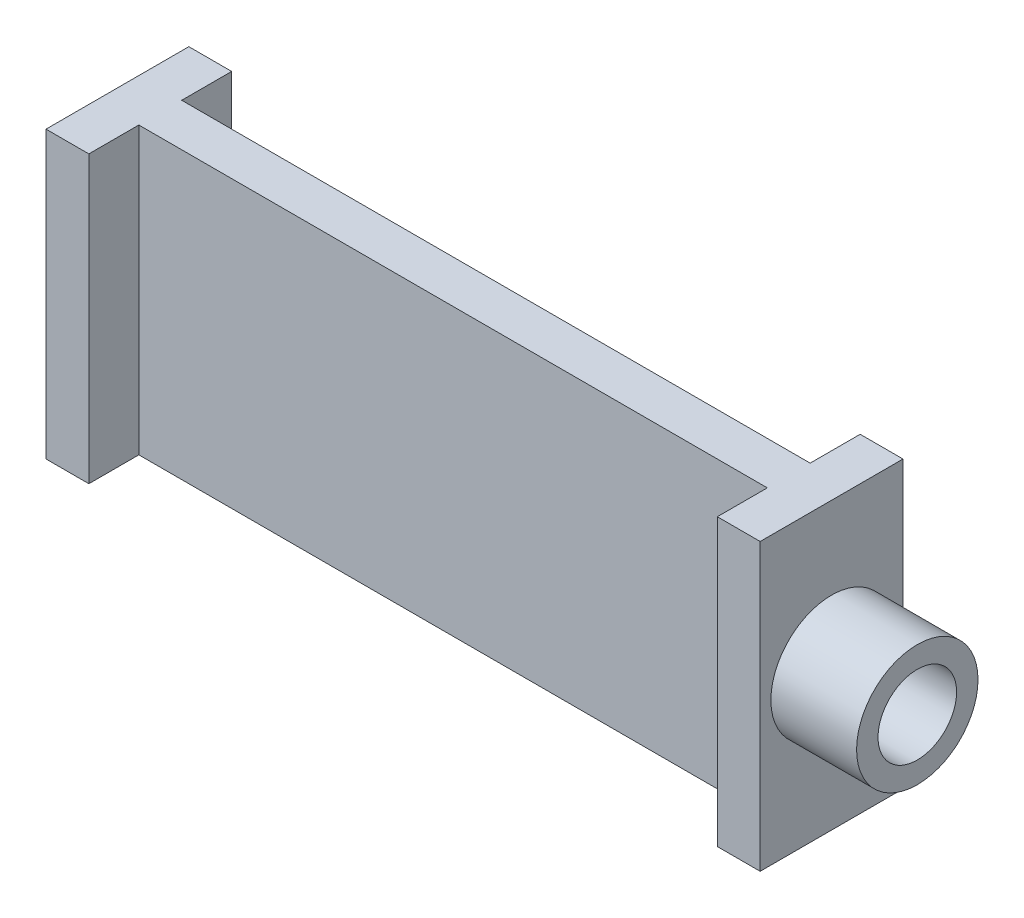
ISO-10303-21;
HEADER;
FILE_DESCRIPTION(('STEP AP214'),'2;1');
FILE_NAME('part.step','',(''),(''),'','','');
FILE_SCHEMA(('AUTOMOTIVE_DESIGN { 1 0 10303 214 1 1 1 1 }'));
ENDSEC;
DATA;
#1=APPLICATION_CONTEXT('core data for automotive mechanical design processes');
#2=APPLICATION_PROTOCOL_DEFINITION('international standard','automotive_design',2000,#1);
#3=PRODUCT_CONTEXT('',#1,'mechanical');
#4=PRODUCT('Part','Part','',(#3));
#5=PRODUCT_RELATED_PRODUCT_CATEGORY('part','',(#4));
#6=PRODUCT_DEFINITION_FORMATION('','',#4);
#7=PRODUCT_DEFINITION_CONTEXT('part definition',#1,'design');
#8=PRODUCT_DEFINITION('design','',#6,#7);
#9=PRODUCT_DEFINITION_SHAPE('','',#8);
#10=(LENGTH_UNIT() NAMED_UNIT(*) SI_UNIT(.MILLI.,.METRE.));
#11=(NAMED_UNIT(*) PLANE_ANGLE_UNIT() SI_UNIT($,.RADIAN.));
#12=(NAMED_UNIT(*) SI_UNIT($,.STERADIAN.) SOLID_ANGLE_UNIT());
#13=UNCERTAINTY_MEASURE_WITH_UNIT(LENGTH_MEASURE(1.E-05),#10,'distance_accuracy_value','');
#14=(GEOMETRIC_REPRESENTATION_CONTEXT(3) GLOBAL_UNCERTAINTY_ASSIGNED_CONTEXT((#13)) GLOBAL_UNIT_ASSIGNED_CONTEXT((#10,
#11,#12)) REPRESENTATION_CONTEXT('',''));
#15=CARTESIAN_POINT('',(0.,0.,0.));
#16=DIRECTION('',(0.,0.,1.));
#17=DIRECTION('',(1.,0.,0.));
#18=AXIS2_PLACEMENT_3D('',#15,#16,#17);
#19=CARTESIAN_POINT('',(6.,40.,0.));
#20=DIRECTION('',(0.,0.,-1.));
#21=DIRECTION('',(-1.,0.,0.));
#22=AXIS2_PLACEMENT_3D('',#19,#20,#21);
#23=PLANE('',#22);
#24=DIRECTION('',(1.,0.,0.));
#25=VECTOR('',#24,1.);
#26=CARTESIAN_POINT('',(6.,0.,0.));
#27=LINE('',#26,#25);
#28=CARTESIAN_POINT('',(0.,0.,0.));
#29=VERTEX_POINT('',#28);
#30=CARTESIAN_POINT('',(6.,0.,0.));
#31=VERTEX_POINT('',#30);
#32=EDGE_CURVE('E154',#29,#31,#27,.T.);
#33=ORIENTED_EDGE('',*,*,#32,.T.);
#34=DIRECTION('',(0.,-1.,0.));
#35=VECTOR('',#34,1.);
#36=CARTESIAN_POINT('',(6.,40.,0.));
#37=LINE('',#36,#35);
#38=CARTESIAN_POINT('',(6.,40.,0.));
#39=VERTEX_POINT('',#38);
#40=EDGE_CURVE('E41',#39,#31,#37,.T.);
#41=ORIENTED_EDGE('',*,*,#40,.F.);
#42=DIRECTION('',(1.,0.,0.));
#43=VECTOR('',#42,1.);
#44=CARTESIAN_POINT('',(6.,40.,0.));
#45=LINE('',#44,#43);
#46=CARTESIAN_POINT('',(0.,40.,0.));
#47=VERTEX_POINT('',#46);
#48=EDGE_CURVE('E177',#47,#39,#45,.T.);
#49=ORIENTED_EDGE('',*,*,#48,.F.);
#50=DIRECTION('',(0.,-1.,0.));
#51=VECTOR('',#50,1.);
#52=CARTESIAN_POINT('',(0.,40.,0.));
#53=LINE('',#52,#51);
#54=EDGE_CURVE('E150',#47,#29,#53,.T.);
#55=ORIENTED_EDGE('',*,*,#54,.T.);
#56=EDGE_LOOP('',(#33,#41,#49,#55));
#57=FACE_BOUND('',#56,.T.);
#58=ADVANCED_FACE('F33',(#57),#23,.F.);
#59=CARTESIAN_POINT('',(6.00000000000003,40.,-7.00000000000001));
#60=DIRECTION('',(-1.,0.,0.));
#61=DIRECTION('',(0.,0.,1.));
#62=AXIS2_PLACEMENT_3D('',#59,#60,#61);
#63=PLANE('',#62);
#64=DIRECTION('',(0.,0.,-1.));
#65=VECTOR('',#64,1.);
#66=CARTESIAN_POINT('',(6.00000000000003,0.,-7.00000000000001));
#67=LINE('',#66,#65);
#68=CARTESIAN_POINT('',(6.00000000000003,0.,-7.00000000000001));
#69=VERTEX_POINT('',#68);
#70=EDGE_CURVE('E157',#31,#69,#67,.T.);
#71=ORIENTED_EDGE('',*,*,#70,.T.);
#72=DIRECTION('',(0.,-1.,0.));
#73=VECTOR('',#72,1.);
#74=CARTESIAN_POINT('',(6.00000000000003,40.,-7.00000000000001));
#75=LINE('',#74,#73);
#76=CARTESIAN_POINT('',(6.00000000000003,40.,-7.00000000000001));
#77=VERTEX_POINT('',#76);
#78=EDGE_CURVE('E199',#77,#69,#75,.T.);
#79=ORIENTED_EDGE('',*,*,#78,.F.);
#80=DIRECTION('',(0.,0.,-1.));
#81=VECTOR('',#80,1.);
#82=CARTESIAN_POINT('',(6.00000000000003,40.,-7.00000000000001));
#83=LINE('',#82,#81);
#84=EDGE_CURVE('E105',#39,#77,#83,.T.);
#85=ORIENTED_EDGE('',*,*,#84,.F.);
#86=ORIENTED_EDGE('',*,*,#40,.T.);
#87=EDGE_LOOP('',(#71,#79,#85,#86));
#88=FACE_BOUND('',#87,.T.);
#89=ADVANCED_FACE('F202',(#88),#63,.F.);
#90=CARTESIAN_POINT('',(94.,40.,-7.));
#91=DIRECTION('',(0.,0.,-1.));
#92=DIRECTION('',(-1.,0.,0.));
#93=AXIS2_PLACEMENT_3D('',#90,#91,#92);
#94=PLANE('',#93);
#95=DIRECTION('',(1.,0.,0.));
#96=VECTOR('',#95,1.);
#97=CARTESIAN_POINT('',(94.,0.,-7.));
#98=LINE('',#97,#96);
#99=CARTESIAN_POINT('',(94.,0.,-7.));
#100=VERTEX_POINT('',#99);
#101=EDGE_CURVE('E160',#69,#100,#98,.T.);
#102=ORIENTED_EDGE('',*,*,#101,.T.);
#103=DIRECTION('',(0.,-1.,0.));
#104=VECTOR('',#103,1.);
#105=CARTESIAN_POINT('',(94.,40.,-7.));
#106=LINE('',#105,#104);
#107=CARTESIAN_POINT('',(94.,40.,-7.));
#108=VERTEX_POINT('',#107);
#109=EDGE_CURVE('E196',#108,#100,#106,.T.);
#110=ORIENTED_EDGE('',*,*,#109,.F.);
#111=DIRECTION('',(1.,0.,0.));
#112=VECTOR('',#111,1.);
#113=CARTESIAN_POINT('',(94.,40.,-7.));
#114=LINE('',#113,#112);
#115=EDGE_CURVE('E222',#77,#108,#114,.T.);
#116=ORIENTED_EDGE('',*,*,#115,.F.);
#117=ORIENTED_EDGE('',*,*,#78,.T.);
#118=EDGE_LOOP('',(#102,#110,#116,#117));
#119=FACE_BOUND('',#118,.T.);
#120=ADVANCED_FACE('F213',(#119),#94,.F.);
#121=CARTESIAN_POINT('',(94.,40.,0.));
#122=DIRECTION('',(1.,0.,0.));
#123=DIRECTION('',(0.,0.,-1.));
#124=AXIS2_PLACEMENT_3D('',#121,#122,#123);
#125=PLANE('',#124);
#126=DIRECTION('',(0.,0.,1.));
#127=VECTOR('',#126,1.);
#128=CARTESIAN_POINT('',(94.,0.,0.));
#129=LINE('',#128,#127);
#130=CARTESIAN_POINT('',(94.,0.,0.));
#131=VERTEX_POINT('',#130);
#132=EDGE_CURVE('E162',#100,#131,#129,.T.);
#133=ORIENTED_EDGE('',*,*,#132,.T.);
#134=DIRECTION('',(0.,-1.,0.));
#135=VECTOR('',#134,1.);
#136=CARTESIAN_POINT('',(94.,40.,0.));
#137=LINE('',#136,#135);
#138=CARTESIAN_POINT('',(94.,40.,0.));
#139=VERTEX_POINT('',#138);
#140=EDGE_CURVE('E193',#139,#131,#137,.T.);
#141=ORIENTED_EDGE('',*,*,#140,.F.);
#142=DIRECTION('',(0.,0.,1.));
#143=VECTOR('',#142,1.);
#144=CARTESIAN_POINT('',(94.,40.,0.));
#145=LINE('',#144,#143);
#146=EDGE_CURVE('E219',#108,#139,#145,.T.);
#147=ORIENTED_EDGE('',*,*,#146,.F.);
#148=ORIENTED_EDGE('',*,*,#109,.T.);
#149=EDGE_LOOP('',(#133,#141,#147,#148));
#150=FACE_BOUND('',#149,.T.);
#151=ADVANCED_FACE('F217',(#150),#125,.F.);
#152=CARTESIAN_POINT('',(100.,40.,0.));
#153=DIRECTION('',(0.,0.,-1.));
#154=DIRECTION('',(-1.,0.,0.));
#155=AXIS2_PLACEMENT_3D('',#152,#153,#154);
#156=PLANE('',#155);
#157=DIRECTION('',(1.,0.,0.));
#158=VECTOR('',#157,1.);
#159=CARTESIAN_POINT('',(100.,0.,0.));
#160=LINE('',#159,#158);
#161=CARTESIAN_POINT('',(100.,0.,0.));
#162=VERTEX_POINT('',#161);
#163=EDGE_CURVE('E164',#131,#162,#160,.T.);
#164=ORIENTED_EDGE('',*,*,#163,.T.);
#165=DIRECTION('',(0.,-1.,0.));
#166=VECTOR('',#165,1.);
#167=CARTESIAN_POINT('',(100.,40.,0.));
#168=LINE('',#167,#166);
#169=CARTESIAN_POINT('',(100.,40.,0.));
#170=VERTEX_POINT('',#169);
#171=EDGE_CURVE('E190',#170,#162,#168,.T.);
#172=ORIENTED_EDGE('',*,*,#171,.F.);
#173=DIRECTION('',(1.,0.,0.));
#174=VECTOR('',#173,1.);
#175=CARTESIAN_POINT('',(100.,40.,0.));
#176=LINE('',#175,#174);
#177=EDGE_CURVE('E221',#139,#170,#176,.T.);
#178=ORIENTED_EDGE('',*,*,#177,.F.);
#179=ORIENTED_EDGE('',*,*,#140,.T.);
#180=EDGE_LOOP('',(#164,#172,#178,#179));
#181=FACE_BOUND('',#180,.T.);
#182=ADVANCED_FACE('F253',(#181),#156,.F.);
#183=CARTESIAN_POINT('',(100.,40.,-20.));
#184=DIRECTION('',(-1.,0.,0.));
#185=DIRECTION('',(0.,0.,1.));
#186=AXIS2_PLACEMENT_3D('',#183,#184,#185);
#187=PLANE('',#186);
#188=CARTESIAN_POINT('',(100.,20.,-10.));
#189=DIRECTION('',(-1.,0.,0.));
#190=DIRECTION('',(0.,0.,1.));
#191=AXIS2_PLACEMENT_3D('',#188,#189,#190);
#192=CIRCLE('',#191,8.49999999999999);
#193=CARTESIAN_POINT('',(100.,20.,-1.50000000000002));
#194=VERTEX_POINT('',#193);
#195=EDGE_CURVE('E11',#194,#194,#192,.F.);
#196=ORIENTED_EDGE('',*,*,#195,.F.);
#197=EDGE_LOOP('',(#196));
#198=FACE_BOUND('',#197,.T.);
#199=DIRECTION('',(0.,0.,-1.));
#200=VECTOR('',#199,1.);
#201=CARTESIAN_POINT('',(100.,0.,-20.));
#202=LINE('',#201,#200);
#203=CARTESIAN_POINT('',(100.,0.,-20.));
#204=VERTEX_POINT('',#203);
#205=EDGE_CURVE('E166',#162,#204,#202,.T.);
#206=ORIENTED_EDGE('',*,*,#205,.T.);
#207=DIRECTION('',(0.,-1.,0.));
#208=VECTOR('',#207,1.);
#209=CARTESIAN_POINT('',(100.,40.,-20.));
#210=LINE('',#209,#208);
#211=CARTESIAN_POINT('',(100.,40.,-20.));
#212=VERTEX_POINT('',#211);
#213=EDGE_CURVE('E187',#212,#204,#210,.T.);
#214=ORIENTED_EDGE('',*,*,#213,.F.);
#215=DIRECTION('',(0.,0.,-1.));
#216=VECTOR('',#215,1.);
#217=CARTESIAN_POINT('',(100.,40.,-20.));
#218=LINE('',#217,#216);
#219=EDGE_CURVE('E224',#170,#212,#218,.T.);
#220=ORIENTED_EDGE('',*,*,#219,.F.);
#221=ORIENTED_EDGE('',*,*,#171,.T.);
#222=EDGE_LOOP('',(#206,#214,#220,#221));
#223=FACE_BOUND('',#222,.T.);
#224=ADVANCED_FACE('F250',(#198,#223),#187,.F.);
#225=CARTESIAN_POINT('',(94.,40.,-20.));
#226=DIRECTION('',(0.,0.,1.));
#227=DIRECTION('',(1.,0.,0.));
#228=AXIS2_PLACEMENT_3D('',#225,#226,#227);
#229=PLANE('',#228);
#230=DIRECTION('',(-1.,0.,0.));
#231=VECTOR('',#230,1.);
#232=CARTESIAN_POINT('',(94.,0.,-20.));
#233=LINE('',#232,#231);
#234=CARTESIAN_POINT('',(94.,0.,-20.));
#235=VERTEX_POINT('',#234);
#236=EDGE_CURVE('E168',#204,#235,#233,.T.);
#237=ORIENTED_EDGE('',*,*,#236,.T.);
#238=DIRECTION('',(0.,-1.,0.));
#239=VECTOR('',#238,1.);
#240=CARTESIAN_POINT('',(94.,40.,-20.));
#241=LINE('',#240,#239);
#242=CARTESIAN_POINT('',(94.,40.,-20.));
#243=VERTEX_POINT('',#242);
#244=EDGE_CURVE('E184',#243,#235,#241,.T.);
#245=ORIENTED_EDGE('',*,*,#244,.F.);
#246=DIRECTION('',(-1.,0.,0.));
#247=VECTOR('',#246,1.);
#248=CARTESIAN_POINT('',(94.,40.,-20.));
#249=LINE('',#248,#247);
#250=EDGE_CURVE('E230',#212,#243,#249,.T.);
#251=ORIENTED_EDGE('',*,*,#250,.F.);
#252=ORIENTED_EDGE('',*,*,#213,.T.);
#253=EDGE_LOOP('',(#237,#245,#251,#252));
#254=FACE_BOUND('',#253,.T.);
#255=ADVANCED_FACE('F246',(#254),#229,.F.);
#256=CARTESIAN_POINT('',(94.,40.,-13.));
#257=DIRECTION('',(1.,0.,0.));
#258=DIRECTION('',(0.,0.,-1.));
#259=AXIS2_PLACEMENT_3D('',#256,#257,#258);
#260=PLANE('',#259);
#261=DIRECTION('',(0.,0.,1.));
#262=VECTOR('',#261,1.);
#263=CARTESIAN_POINT('',(94.,0.,-13.));
#264=LINE('',#263,#262);
#265=CARTESIAN_POINT('',(94.,0.,-13.));
#266=VERTEX_POINT('',#265);
#267=EDGE_CURVE('E170',#235,#266,#264,.T.);
#268=ORIENTED_EDGE('',*,*,#267,.T.);
#269=DIRECTION('',(0.,-1.,0.));
#270=VECTOR('',#269,1.);
#271=CARTESIAN_POINT('',(94.,40.,-13.));
#272=LINE('',#271,#270);
#273=CARTESIAN_POINT('',(94.,40.,-13.));
#274=VERTEX_POINT('',#273);
#275=EDGE_CURVE('E181',#274,#266,#272,.T.);
#276=ORIENTED_EDGE('',*,*,#275,.F.);
#277=DIRECTION('',(0.,0.,1.));
#278=VECTOR('',#277,1.);
#279=CARTESIAN_POINT('',(94.,40.,-13.));
#280=LINE('',#279,#278);
#281=EDGE_CURVE('E232',#243,#274,#280,.T.);
#282=ORIENTED_EDGE('',*,*,#281,.F.);
#283=ORIENTED_EDGE('',*,*,#244,.T.);
#284=EDGE_LOOP('',(#268,#276,#282,#283));
#285=FACE_BOUND('',#284,.T.);
#286=ADVANCED_FACE('F238',(#285),#260,.F.);
#287=CARTESIAN_POINT('',(6.00000000000006,40.,-13.));
#288=DIRECTION('',(0.,0.,1.));
#289=DIRECTION('',(1.,0.,0.));
#290=AXIS2_PLACEMENT_3D('',#287,#288,#289);
#291=PLANE('',#290);
#292=DIRECTION('',(-1.,0.,0.));
#293=VECTOR('',#292,1.);
#294=CARTESIAN_POINT('',(6.00000000000006,0.,-13.));
#295=LINE('',#294,#293);
#296=CARTESIAN_POINT('',(6.00000000000006,0.,-13.));
#297=VERTEX_POINT('',#296);
#298=EDGE_CURVE('E172',#266,#297,#295,.T.);
#299=ORIENTED_EDGE('',*,*,#298,.T.);
#300=DIRECTION('',(0.,-1.,0.));
#301=VECTOR('',#300,1.);
#302=CARTESIAN_POINT('',(6.00000000000006,40.,-13.));
#303=LINE('',#302,#301);
#304=CARTESIAN_POINT('',(6.00000000000006,40.,-13.));
#305=VERTEX_POINT('',#304);
#306=EDGE_CURVE('E145',#305,#297,#303,.T.);
#307=ORIENTED_EDGE('',*,*,#306,.F.);
#308=DIRECTION('',(-1.,0.,0.));
#309=VECTOR('',#308,1.);
#310=CARTESIAN_POINT('',(6.00000000000006,40.,-13.));
#311=LINE('',#310,#309);
#312=EDGE_CURVE('E136',#274,#305,#311,.T.);
#313=ORIENTED_EDGE('',*,*,#312,.F.);
#314=ORIENTED_EDGE('',*,*,#275,.T.);
#315=EDGE_LOOP('',(#299,#307,#313,#314));
#316=FACE_BOUND('',#315,.T.);
#317=ADVANCED_FACE('F242',(#316),#291,.F.);
#318=CARTESIAN_POINT('',(6.00000000000006,40.,-20.));
#319=DIRECTION('',(-1.,0.,0.));
#320=DIRECTION('',(0.,0.,1.));
#321=AXIS2_PLACEMENT_3D('',#318,#319,#320);
#322=PLANE('',#321);
#323=DIRECTION('',(0.,0.,-1.));
#324=VECTOR('',#323,1.);
#325=CARTESIAN_POINT('',(6.00000000000006,0.,-20.));
#326=LINE('',#325,#324);
#327=CARTESIAN_POINT('',(6.00000000000006,0.,-20.));
#328=VERTEX_POINT('',#327);
#329=EDGE_CURVE('E144',#297,#328,#326,.T.);
#330=ORIENTED_EDGE('',*,*,#329,.T.);
#331=DIRECTION('',(0.,-1.,0.));
#332=VECTOR('',#331,1.);
#333=CARTESIAN_POINT('',(6.00000000000006,40.,-20.));
#334=LINE('',#333,#332);
#335=CARTESIAN_POINT('',(6.00000000000006,40.,-20.));
#336=VERTEX_POINT('',#335);
#337=EDGE_CURVE('E141',#336,#328,#334,.T.);
#338=ORIENTED_EDGE('',*,*,#337,.F.);
#339=DIRECTION('',(0.,0.,-1.));
#340=VECTOR('',#339,1.);
#341=CARTESIAN_POINT('',(6.00000000000006,40.,-20.));
#342=LINE('',#341,#340);
#343=EDGE_CURVE('E130',#305,#336,#342,.T.);
#344=ORIENTED_EDGE('',*,*,#343,.F.);
#345=ORIENTED_EDGE('',*,*,#306,.T.);
#346=EDGE_LOOP('',(#330,#338,#344,#345));
#347=FACE_BOUND('',#346,.T.);
#348=ADVANCED_FACE('F142',(#347),#322,.F.);
#349=CARTESIAN_POINT('',(0.,40.,-20.));
#350=DIRECTION('',(0.,0.,1.));
#351=DIRECTION('',(1.,0.,0.));
#352=AXIS2_PLACEMENT_3D('',#349,#350,#351);
#353=PLANE('',#352);
#354=DIRECTION('',(-1.,0.,0.));
#355=VECTOR('',#354,1.);
#356=CARTESIAN_POINT('',(0.,0.,-20.));
#357=LINE('',#356,#355);
#358=CARTESIAN_POINT('',(0.,0.,-20.));
#359=VERTEX_POINT('',#358);
#360=EDGE_CURVE('E90',#328,#359,#357,.T.);
#361=ORIENTED_EDGE('',*,*,#360,.T.);
#362=DIRECTION('',(0.,-1.,0.));
#363=VECTOR('',#362,1.);
#364=CARTESIAN_POINT('',(0.,40.,-20.));
#365=LINE('',#364,#363);
#366=CARTESIAN_POINT('',(0.,40.,-20.));
#367=VERTEX_POINT('',#366);
#368=EDGE_CURVE('E146',#367,#359,#365,.T.);
#369=ORIENTED_EDGE('',*,*,#368,.F.);
#370=DIRECTION('',(-1.,0.,0.));
#371=VECTOR('',#370,1.);
#372=CARTESIAN_POINT('',(0.,40.,-20.));
#373=LINE('',#372,#371);
#374=EDGE_CURVE('E134',#336,#367,#373,.T.);
#375=ORIENTED_EDGE('',*,*,#374,.F.);
#376=ORIENTED_EDGE('',*,*,#337,.T.);
#377=EDGE_LOOP('',(#361,#369,#375,#376));
#378=FACE_BOUND('',#377,.T.);
#379=ADVANCED_FACE('F148',(#378),#353,.F.);
#380=CARTESIAN_POINT('',(0.,40.,0.));
#381=DIRECTION('',(1.,0.,0.));
#382=DIRECTION('',(0.,0.,-1.));
#383=AXIS2_PLACEMENT_3D('',#380,#381,#382);
#384=PLANE('',#383);
#385=DIRECTION('',(0.,0.,1.));
#386=VECTOR('',#385,1.);
#387=CARTESIAN_POINT('',(0.,0.,0.));
#388=LINE('',#387,#386);
#389=EDGE_CURVE('E96',#359,#29,#388,.T.);
#390=ORIENTED_EDGE('',*,*,#389,.T.);
#391=ORIENTED_EDGE('',*,*,#54,.F.);
#392=DIRECTION('',(0.,0.,1.));
#393=VECTOR('',#392,1.);
#394=CARTESIAN_POINT('',(0.,40.,0.));
#395=LINE('',#394,#393);
#396=EDGE_CURVE('E49',#367,#47,#395,.T.);
#397=ORIENTED_EDGE('',*,*,#396,.F.);
#398=ORIENTED_EDGE('',*,*,#368,.T.);
#399=EDGE_LOOP('',(#390,#391,#397,#398));
#400=FACE_BOUND('',#399,.T.);
#401=ADVANCED_FACE('F324',(#400),#384,.F.);
#402=CARTESIAN_POINT('',(0.,40.,0.));
#403=DIRECTION('',(0.,-1.,0.));
#404=DIRECTION('',(0.,0.,-1.));
#405=AXIS2_PLACEMENT_3D('',#402,#403,#404);
#406=PLANE('',#405);
#407=ORIENTED_EDGE('',*,*,#48,.T.);
#408=ORIENTED_EDGE('',*,*,#84,.T.);
#409=ORIENTED_EDGE('',*,*,#115,.T.);
#410=ORIENTED_EDGE('',*,*,#146,.T.);
#411=ORIENTED_EDGE('',*,*,#177,.T.);
#412=ORIENTED_EDGE('',*,*,#219,.T.);
#413=ORIENTED_EDGE('',*,*,#250,.T.);
#414=ORIENTED_EDGE('',*,*,#281,.T.);
#415=ORIENTED_EDGE('',*,*,#312,.T.);
#416=ORIENTED_EDGE('',*,*,#343,.T.);
#417=ORIENTED_EDGE('',*,*,#374,.T.);
#418=ORIENTED_EDGE('',*,*,#396,.T.);
#419=EDGE_LOOP('',(#407,#408,#409,#410,#411,#412,#413,#414,#415,#416,#417,#418));
#420=FACE_BOUND('',#419,.T.);
#421=ADVANCED_FACE('F132',(#420),#406,.F.);
#422=CARTESIAN_POINT('',(0.,0.,0.));
#423=DIRECTION('',(0.,-1.,0.));
#424=DIRECTION('',(0.,0.,-1.));
#425=AXIS2_PLACEMENT_3D('',#422,#423,#424);
#426=PLANE('',#425);
#427=ORIENTED_EDGE('',*,*,#32,.F.);
#428=ORIENTED_EDGE('',*,*,#389,.F.);
#429=ORIENTED_EDGE('',*,*,#360,.F.);
#430=ORIENTED_EDGE('',*,*,#329,.F.);
#431=ORIENTED_EDGE('',*,*,#298,.F.);
#432=ORIENTED_EDGE('',*,*,#267,.F.);
#433=ORIENTED_EDGE('',*,*,#236,.F.);
#434=ORIENTED_EDGE('',*,*,#205,.F.);
#435=ORIENTED_EDGE('',*,*,#163,.F.);
#436=ORIENTED_EDGE('',*,*,#132,.F.);
#437=ORIENTED_EDGE('',*,*,#101,.F.);
#438=ORIENTED_EDGE('',*,*,#70,.F.);
#439=EDGE_LOOP('',(#427,#428,#429,#430,#431,#432,#433,#434,#435,#436,#437,#438));
#440=FACE_BOUND('',#439,.T.);
#441=ADVANCED_FACE('F207',(#440),#426,.T.);
#442=CARTESIAN_POINT('',(112.,20.,-10.));
#443=DIRECTION('',(1.,0.,0.));
#444=DIRECTION('',(0.,0.,-1.));
#445=AXIS2_PLACEMENT_3D('',#442,#443,#444);
#446=PLANE('',#445);
#447=CARTESIAN_POINT('',(112.,20.,-10.));
#448=DIRECTION('',(1.,0.,0.));
#449=DIRECTION('',(0.,0.,-1.));
#450=AXIS2_PLACEMENT_3D('',#447,#448,#449);
#451=CIRCLE('',#450,8.49999999999999);
#452=CARTESIAN_POINT('',(112.,20.,-18.5));
#453=VERTEX_POINT('',#452);
#454=EDGE_CURVE('E158',#453,#453,#451,.T.);
#455=ORIENTED_EDGE('',*,*,#454,.T.);
#456=EDGE_LOOP('',(#455));
#457=FACE_BOUND('',#456,.T.);
#458=CARTESIAN_POINT('',(112.,20.,-10.));
#459=DIRECTION('',(1.,0.,0.));
#460=DIRECTION('',(0.,0.,-1.));
#461=AXIS2_PLACEMENT_3D('',#458,#459,#460);
#462=CIRCLE('',#461,5.49999999999999);
#463=CARTESIAN_POINT('',(112.,20.,-15.5));
#464=VERTEX_POINT('',#463);
#465=EDGE_CURVE('E399',#464,#464,#462,.T.);
#466=ORIENTED_EDGE('',*,*,#465,.F.);
#467=EDGE_LOOP('',(#466));
#468=FACE_BOUND('',#467,.T.);
#469=ADVANCED_FACE('F349',(#457,#468),#446,.T.);
#470=CARTESIAN_POINT('',(112.,20.,-10.));
#471=DIRECTION('',(-1.,0.,0.));
#472=DIRECTION('',(0.,0.,1.));
#473=AXIS2_PLACEMENT_3D('',#470,#471,#472);
#474=CYLINDRICAL_SURFACE('',#473,8.49999999999999);
#475=ORIENTED_EDGE('',*,*,#454,.F.);
#476=EDGE_LOOP('',(#475));
#477=FACE_BOUND('',#476,.T.);
#478=ORIENTED_EDGE('',*,*,#195,.T.);
#479=EDGE_LOOP('',(#478));
#480=FACE_BOUND('',#479,.T.);
#481=ADVANCED_FACE('F364',(#477,#480),#474,.T.);
#482=CARTESIAN_POINT('',(112.,20.,-10.));
#483=DIRECTION('',(-1.,0.,0.));
#484=DIRECTION('',(0.,0.,1.));
#485=AXIS2_PLACEMENT_3D('',#482,#483,#484);
#486=CYLINDRICAL_SURFACE('',#485,5.49999999999999);
#487=ORIENTED_EDGE('',*,*,#465,.T.);
#488=EDGE_LOOP('',(#487));
#489=FACE_BOUND('',#488,.T.);
#490=CARTESIAN_POINT('',(100.,20.,-10.));
#491=DIRECTION('',(1.,0.,0.));
#492=DIRECTION('',(0.,0.,-1.));
#493=AXIS2_PLACEMENT_3D('',#490,#491,#492);
#494=CIRCLE('',#493,5.49999999999999);
#495=CARTESIAN_POINT('',(100.,20.,-15.5));
#496=VERTEX_POINT('',#495);
#497=EDGE_CURVE('E397',#496,#496,#494,.T.);
#498=ORIENTED_EDGE('',*,*,#497,.F.);
#499=EDGE_LOOP('',(#498));
#500=FACE_BOUND('',#499,.T.);
#501=ADVANCED_FACE('F374',(#489,#500),#486,.F.);
#502=ORIENTED_EDGE('',*,*,#497,.T.);
#503=EDGE_LOOP('',(#502));
#504=FACE_BOUND('',#503,.T.);
#505=ADVANCED_FACE('F262',(#504),#187,.F.);
#506=CLOSED_SHELL('',(#58,#89,#120,#151,#182,#224,#255,#286,#317,#348,#379,#401,#421,#441,#469,
#481,#501,#505));
#507=MANIFOLD_SOLID_BREP('B2',#506);
#508=ADVANCED_BREP_SHAPE_REPRESENTATION('',(#18,#507),#14);
#509=SHAPE_DEFINITION_REPRESENTATION(#9,#508);
ENDSEC;
END-ISO-10303-21;
